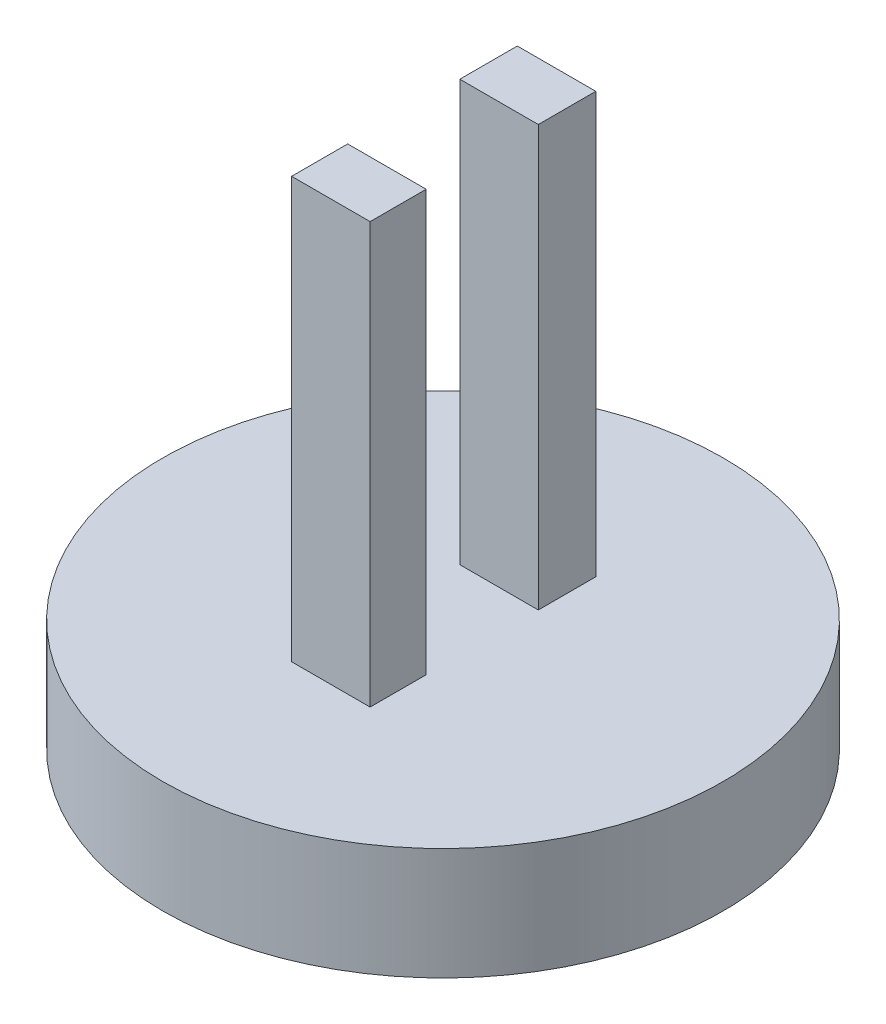
ISO-10303-21;
HEADER;
FILE_DESCRIPTION(('STEP AP214'),'2;1');
FILE_NAME('part.step','',(''),(''),'','','');
FILE_SCHEMA(('AUTOMOTIVE_DESIGN { 1 0 10303 214 1 1 1 1 }'));
ENDSEC;
DATA;
#1=APPLICATION_CONTEXT('core data for automotive mechanical design processes');
#2=APPLICATION_PROTOCOL_DEFINITION('international standard','automotive_design',2000,#1);
#3=PRODUCT_CONTEXT('',#1,'mechanical');
#4=PRODUCT('Part','Part','',(#3));
#5=PRODUCT_RELATED_PRODUCT_CATEGORY('part','',(#4));
#6=PRODUCT_DEFINITION_FORMATION('','',#4);
#7=PRODUCT_DEFINITION_CONTEXT('part definition',#1,'design');
#8=PRODUCT_DEFINITION('design','',#6,#7);
#9=PRODUCT_DEFINITION_SHAPE('','',#8);
#10=(LENGTH_UNIT() NAMED_UNIT(*) SI_UNIT(.MILLI.,.METRE.));
#11=(NAMED_UNIT(*) PLANE_ANGLE_UNIT() SI_UNIT($,.RADIAN.));
#12=(NAMED_UNIT(*) SI_UNIT($,.STERADIAN.) SOLID_ANGLE_UNIT());
#13=UNCERTAINTY_MEASURE_WITH_UNIT(LENGTH_MEASURE(1.E-05),#10,'distance_accuracy_value','');
#14=(GEOMETRIC_REPRESENTATION_CONTEXT(3) GLOBAL_UNCERTAINTY_ASSIGNED_CONTEXT((#13)) GLOBAL_UNIT_ASSIGNED_CONTEXT((#10,
#11,#12)) REPRESENTATION_CONTEXT('',''));
#15=CARTESIAN_POINT('',(0.,0.,0.));
#16=DIRECTION('',(0.,0.,1.));
#17=DIRECTION('',(1.,0.,0.));
#18=AXIS2_PLACEMENT_3D('',#15,#16,#17);
#19=CARTESIAN_POINT('',(0.,5.08,0.));
#20=DIRECTION('',(0.,1.,0.));
#21=DIRECTION('',(0.,0.,1.));
#22=AXIS2_PLACEMENT_3D('',#19,#20,#21);
#23=PLANE('',#22);
#24=DIRECTION('',(0.,0.,-1.));
#25=VECTOR('',#24,1.);
#26=CARTESIAN_POINT('',(-1.778,5.08,-2.54));
#27=LINE('',#26,#25);
#28=CARTESIAN_POINT('',(-1.778,5.08,-2.54));
#29=VERTEX_POINT('',#28);
#30=CARTESIAN_POINT('',(-1.778,5.08,-5.14465691805223));
#31=VERTEX_POINT('',#30);
#32=EDGE_CURVE('E110',#29,#31,#27,.T.);
#33=ORIENTED_EDGE('',*,*,#32,.T.);
#34=DIRECTION('',(1.,0.,0.));
#35=VECTOR('',#34,1.);
#36=CARTESIAN_POINT('',(-1.778,5.08,-5.14465691805223));
#37=LINE('',#36,#35);
#38=CARTESIAN_POINT('',(1.778,5.08,-5.14465691805223));
#39=VERTEX_POINT('',#38);
#40=EDGE_CURVE('E162',#31,#39,#37,.T.);
#41=ORIENTED_EDGE('',*,*,#40,.T.);
#42=DIRECTION('',(0.,0.,-1.));
#43=VECTOR('',#42,1.);
#44=CARTESIAN_POINT('',(1.778,5.08,-2.54));
#45=LINE('',#44,#43);
#46=CARTESIAN_POINT('',(1.778,5.08,-2.54));
#47=VERTEX_POINT('',#46);
#48=EDGE_CURVE('E165',#47,#39,#45,.T.);
#49=ORIENTED_EDGE('',*,*,#48,.F.);
#50=DIRECTION('',(1.,0.,0.));
#51=VECTOR('',#50,1.);
#52=CARTESIAN_POINT('',(-1.778,5.08,-2.54));
#53=LINE('',#52,#51);
#54=EDGE_CURVE('E149',#29,#47,#53,.T.);
#55=ORIENTED_EDGE('',*,*,#54,.F.);
#56=EDGE_LOOP('',(#33,#41,#49,#55));
#57=FACE_BOUND('',#56,.T.);
#58=CARTESIAN_POINT('',(0.,5.08,0.));
#59=DIRECTION('',(0.,1.,0.));
#60=DIRECTION('',(0.,0.,1.));
#61=AXIS2_PLACEMENT_3D('',#58,#59,#60);
#62=CIRCLE('',#61,12.7);
#63=CARTESIAN_POINT('',(0.,5.08,12.7));
#64=VERTEX_POINT('',#63);
#65=EDGE_CURVE('E11',#64,#64,#62,.T.);
#66=ORIENTED_EDGE('',*,*,#65,.T.);
#67=EDGE_LOOP('',(#66));
#68=FACE_BOUND('',#67,.T.);
#69=DIRECTION('',(1.,0.,0.));
#70=VECTOR('',#69,1.);
#71=CARTESIAN_POINT('',(-1.778,5.08,5.08));
#72=LINE('',#71,#70);
#73=CARTESIAN_POINT('',(-1.778,5.08,5.08));
#74=VERTEX_POINT('',#73);
#75=CARTESIAN_POINT('',(1.778,5.08,5.08));
#76=VERTEX_POINT('',#75);
#77=EDGE_CURVE('E55',#74,#76,#72,.T.);
#78=ORIENTED_EDGE('',*,*,#77,.F.);
#79=DIRECTION('',(0.,0.,1.));
#80=VECTOR('',#79,1.);
#81=CARTESIAN_POINT('',(-1.778,5.08,2.54));
#82=LINE('',#81,#80);
#83=CARTESIAN_POINT('',(-1.778,5.08,2.54));
#84=VERTEX_POINT('',#83);
#85=EDGE_CURVE('E102',#84,#74,#82,.T.);
#86=ORIENTED_EDGE('',*,*,#85,.F.);
#87=DIRECTION('',(1.,0.,0.));
#88=VECTOR('',#87,1.);
#89=CARTESIAN_POINT('',(-1.778,5.08,2.54));
#90=LINE('',#89,#88);
#91=CARTESIAN_POINT('',(1.778,5.08,2.54));
#92=VERTEX_POINT('',#91);
#93=EDGE_CURVE('E105',#84,#92,#90,.T.);
#94=ORIENTED_EDGE('',*,*,#93,.T.);
#95=DIRECTION('',(0.,0.,1.));
#96=VECTOR('',#95,1.);
#97=CARTESIAN_POINT('',(1.778,5.08,2.54));
#98=LINE('',#97,#96);
#99=EDGE_CURVE('E60',#92,#76,#98,.T.);
#100=ORIENTED_EDGE('',*,*,#99,.T.);
#101=EDGE_LOOP('',(#78,#86,#94,#100));
#102=FACE_BOUND('',#101,.T.);
#103=ADVANCED_FACE('F39',(#57,#68,#102),#23,.T.);
#104=CARTESIAN_POINT('',(0.,5.08,0.));
#105=DIRECTION('',(0.,-1.,0.));
#106=DIRECTION('',(0.,0.,-1.));
#107=AXIS2_PLACEMENT_3D('',#104,#105,#106);
#108=CYLINDRICAL_SURFACE('',#107,12.7);
#109=ORIENTED_EDGE('',*,*,#65,.F.);
#110=EDGE_LOOP('',(#109));
#111=FACE_BOUND('',#110,.T.);
#112=CARTESIAN_POINT('',(0.,0.,0.));
#113=DIRECTION('',(0.,1.,0.));
#114=DIRECTION('',(0.,0.,1.));
#115=AXIS2_PLACEMENT_3D('',#112,#113,#114);
#116=CIRCLE('',#115,12.7);
#117=CARTESIAN_POINT('',(0.,0.,12.7));
#118=VERTEX_POINT('',#117);
#119=EDGE_CURVE('E43',#118,#118,#116,.T.);
#120=ORIENTED_EDGE('',*,*,#119,.T.);
#121=EDGE_LOOP('',(#120));
#122=FACE_BOUND('',#121,.T.);
#123=ADVANCED_FACE('F41',(#111,#122),#108,.T.);
#124=CARTESIAN_POINT('',(0.,0.,0.));
#125=DIRECTION('',(0.,1.,0.));
#126=DIRECTION('',(0.,0.,1.));
#127=AXIS2_PLACEMENT_3D('',#124,#125,#126);
#128=PLANE('',#127);
#129=ORIENTED_EDGE('',*,*,#119,.F.);
#130=EDGE_LOOP('',(#129));
#131=FACE_BOUND('',#130,.T.);
#132=ADVANCED_FACE('F219',(#131),#128,.F.);
#133=CARTESIAN_POINT('',(-1.778,24.13,-2.54));
#134=DIRECTION('',(-1.,0.,0.));
#135=DIRECTION('',(0.,0.,1.));
#136=AXIS2_PLACEMENT_3D('',#133,#134,#135);
#137=PLANE('',#136);
#138=ORIENTED_EDGE('',*,*,#32,.F.);
#139=DIRECTION('',(0.,-1.,0.));
#140=VECTOR('',#139,1.);
#141=CARTESIAN_POINT('',(-1.778,24.13,-2.54));
#142=LINE('',#141,#140);
#143=CARTESIAN_POINT('',(-1.778,24.13,-2.54));
#144=VERTEX_POINT('',#143);
#145=EDGE_CURVE('E172',#144,#29,#142,.T.);
#146=ORIENTED_EDGE('',*,*,#145,.F.);
#147=DIRECTION('',(0.,0.,-1.));
#148=VECTOR('',#147,1.);
#149=CARTESIAN_POINT('',(-1.778,24.13,-2.54));
#150=LINE('',#149,#148);
#151=CARTESIAN_POINT('',(-1.778,24.13,-5.14465691805223));
#152=VERTEX_POINT('',#151);
#153=EDGE_CURVE('E144',#144,#152,#150,.T.);
#154=ORIENTED_EDGE('',*,*,#153,.T.);
#155=DIRECTION('',(0.,-1.,0.));
#156=VECTOR('',#155,1.);
#157=CARTESIAN_POINT('',(-1.778,24.13,-5.14465691805223));
#158=LINE('',#157,#156);
#159=EDGE_CURVE('E159',#152,#31,#158,.T.);
#160=ORIENTED_EDGE('',*,*,#159,.T.);
#161=EDGE_LOOP('',(#138,#146,#154,#160));
#162=FACE_BOUND('',#161,.T.);
#163=ADVANCED_FACE('F189',(#162),#137,.T.);
#164=CARTESIAN_POINT('',(-1.778,24.13,-2.54));
#165=DIRECTION('',(0.,0.,-1.));
#166=DIRECTION('',(-1.,0.,0.));
#167=AXIS2_PLACEMENT_3D('',#164,#165,#166);
#168=PLANE('',#167);
#169=ORIENTED_EDGE('',*,*,#54,.T.);
#170=DIRECTION('',(0.,-1.,0.));
#171=VECTOR('',#170,1.);
#172=CARTESIAN_POINT('',(1.778,24.13,-2.54));
#173=LINE('',#172,#171);
#174=CARTESIAN_POINT('',(1.778,24.13,-2.54));
#175=VERTEX_POINT('',#174);
#176=EDGE_CURVE('E176',#175,#47,#173,.T.);
#177=ORIENTED_EDGE('',*,*,#176,.F.);
#178=DIRECTION('',(1.,0.,0.));
#179=VECTOR('',#178,1.);
#180=CARTESIAN_POINT('',(-1.778,24.13,-2.54));
#181=LINE('',#180,#179);
#182=EDGE_CURVE('E156',#144,#175,#181,.T.);
#183=ORIENTED_EDGE('',*,*,#182,.F.);
#184=ORIENTED_EDGE('',*,*,#145,.T.);
#185=EDGE_LOOP('',(#169,#177,#183,#184));
#186=FACE_BOUND('',#185,.T.);
#187=ADVANCED_FACE('F200',(#186),#168,.F.);
#188=CARTESIAN_POINT('',(1.778,24.13,-2.54));
#189=DIRECTION('',(-1.,0.,0.));
#190=DIRECTION('',(0.,0.,1.));
#191=AXIS2_PLACEMENT_3D('',#188,#189,#190);
#192=PLANE('',#191);
#193=ORIENTED_EDGE('',*,*,#48,.T.);
#194=DIRECTION('',(0.,-1.,0.));
#195=VECTOR('',#194,1.);
#196=CARTESIAN_POINT('',(1.778,24.13,-5.14465691805223));
#197=LINE('',#196,#195);
#198=CARTESIAN_POINT('',(1.778,24.13,-5.14465691805223));
#199=VERTEX_POINT('',#198);
#200=EDGE_CURVE('E180',#199,#39,#197,.T.);
#201=ORIENTED_EDGE('',*,*,#200,.F.);
#202=DIRECTION('',(0.,0.,-1.));
#203=VECTOR('',#202,1.);
#204=CARTESIAN_POINT('',(1.778,24.13,-2.54));
#205=LINE('',#204,#203);
#206=EDGE_CURVE('E153',#175,#199,#205,.T.);
#207=ORIENTED_EDGE('',*,*,#206,.F.);
#208=ORIENTED_EDGE('',*,*,#176,.T.);
#209=EDGE_LOOP('',(#193,#201,#207,#208));
#210=FACE_BOUND('',#209,.T.);
#211=ADVANCED_FACE('F205',(#210),#192,.F.);
#212=CARTESIAN_POINT('',(-1.778,24.13,-5.14465691805223));
#213=DIRECTION('',(0.,0.,-1.));
#214=DIRECTION('',(-1.,0.,0.));
#215=AXIS2_PLACEMENT_3D('',#212,#213,#214);
#216=PLANE('',#215);
#217=ORIENTED_EDGE('',*,*,#40,.F.);
#218=ORIENTED_EDGE('',*,*,#159,.F.);
#219=DIRECTION('',(1.,0.,0.));
#220=VECTOR('',#219,1.);
#221=CARTESIAN_POINT('',(-1.778,24.13,-5.14465691805223));
#222=LINE('',#221,#220);
#223=EDGE_CURVE('E148',#152,#199,#222,.T.);
#224=ORIENTED_EDGE('',*,*,#223,.T.);
#225=ORIENTED_EDGE('',*,*,#200,.T.);
#226=EDGE_LOOP('',(#217,#218,#224,#225));
#227=FACE_BOUND('',#226,.T.);
#228=ADVANCED_FACE('F193',(#227),#216,.T.);
#229=CARTESIAN_POINT('',(0.,24.13,0.));
#230=DIRECTION('',(0.,-1.,0.));
#231=DIRECTION('',(0.,0.,-1.));
#232=AXIS2_PLACEMENT_3D('',#229,#230,#231);
#233=PLANE('',#232);
#234=ORIENTED_EDGE('',*,*,#153,.F.);
#235=ORIENTED_EDGE('',*,*,#182,.T.);
#236=ORIENTED_EDGE('',*,*,#206,.T.);
#237=ORIENTED_EDGE('',*,*,#223,.F.);
#238=EDGE_LOOP('',(#234,#235,#236,#237));
#239=FACE_BOUND('',#238,.T.);
#240=ADVANCED_FACE('F203',(#239),#233,.F.);
#241=CARTESIAN_POINT('',(-1.778,24.13,2.54));
#242=DIRECTION('',(1.,0.,0.));
#243=DIRECTION('',(0.,0.,-1.));
#244=AXIS2_PLACEMENT_3D('',#241,#242,#243);
#245=PLANE('',#244);
#246=ORIENTED_EDGE('',*,*,#85,.T.);
#247=DIRECTION('',(0.,-1.,0.));
#248=VECTOR('',#247,1.);
#249=CARTESIAN_POINT('',(-1.778,24.13,5.08));
#250=LINE('',#249,#248);
#251=CARTESIAN_POINT('',(-1.778,24.13,5.08));
#252=VERTEX_POINT('',#251);
#253=EDGE_CURVE('E307',#252,#74,#250,.T.);
#254=ORIENTED_EDGE('',*,*,#253,.F.);
#255=DIRECTION('',(0.,0.,1.));
#256=VECTOR('',#255,1.);
#257=CARTESIAN_POINT('',(-1.778,24.13,2.54));
#258=LINE('',#257,#256);
#259=CARTESIAN_POINT('',(-1.778,24.13,2.54));
#260=VERTEX_POINT('',#259);
#261=EDGE_CURVE('E116',#260,#252,#258,.T.);
#262=ORIENTED_EDGE('',*,*,#261,.F.);
#263=DIRECTION('',(0.,-1.,0.));
#264=VECTOR('',#263,1.);
#265=CARTESIAN_POINT('',(-1.778,24.13,2.54));
#266=LINE('',#265,#264);
#267=EDGE_CURVE('E113',#260,#84,#266,.T.);
#268=ORIENTED_EDGE('',*,*,#267,.T.);
#269=EDGE_LOOP('',(#246,#254,#262,#268));
#270=FACE_BOUND('',#269,.T.);
#271=ADVANCED_FACE('F114',(#270),#245,.F.);
#272=CARTESIAN_POINT('',(-1.778,24.13,5.08));
#273=DIRECTION('',(0.,0.,-1.));
#274=DIRECTION('',(-1.,0.,0.));
#275=AXIS2_PLACEMENT_3D('',#272,#273,#274);
#276=PLANE('',#275);
#277=ORIENTED_EDGE('',*,*,#77,.T.);
#278=DIRECTION('',(0.,-1.,0.));
#279=VECTOR('',#278,1.);
#280=CARTESIAN_POINT('',(1.778,24.13,5.08));
#281=LINE('',#280,#279);
#282=CARTESIAN_POINT('',(1.778,24.13,5.08));
#283=VERTEX_POINT('',#282);
#284=EDGE_CURVE('E309',#283,#76,#281,.T.);
#285=ORIENTED_EDGE('',*,*,#284,.F.);
#286=DIRECTION('',(1.,0.,0.));
#287=VECTOR('',#286,1.);
#288=CARTESIAN_POINT('',(-1.778,24.13,5.08));
#289=LINE('',#288,#287);
#290=EDGE_CURVE('E130',#252,#283,#289,.T.);
#291=ORIENTED_EDGE('',*,*,#290,.F.);
#292=ORIENTED_EDGE('',*,*,#253,.T.);
#293=EDGE_LOOP('',(#277,#285,#291,#292));
#294=FACE_BOUND('',#293,.T.);
#295=ADVANCED_FACE('F264',(#294),#276,.F.);
#296=CARTESIAN_POINT('',(1.778,24.13,2.54));
#297=DIRECTION('',(1.,0.,0.));
#298=DIRECTION('',(0.,0.,-1.));
#299=AXIS2_PLACEMENT_3D('',#296,#297,#298);
#300=PLANE('',#299);
#301=ORIENTED_EDGE('',*,*,#99,.F.);
#302=DIRECTION('',(0.,-1.,0.));
#303=VECTOR('',#302,1.);
#304=CARTESIAN_POINT('',(1.778,24.13,2.54));
#305=LINE('',#304,#303);
#306=CARTESIAN_POINT('',(1.778,24.13,2.54));
#307=VERTEX_POINT('',#306);
#308=EDGE_CURVE('E122',#307,#92,#305,.T.);
#309=ORIENTED_EDGE('',*,*,#308,.F.);
#310=DIRECTION('',(0.,0.,1.));
#311=VECTOR('',#310,1.);
#312=CARTESIAN_POINT('',(1.778,24.13,2.54));
#313=LINE('',#312,#311);
#314=EDGE_CURVE('E138',#307,#283,#313,.T.);
#315=ORIENTED_EDGE('',*,*,#314,.T.);
#316=ORIENTED_EDGE('',*,*,#284,.T.);
#317=EDGE_LOOP('',(#301,#309,#315,#316));
#318=FACE_BOUND('',#317,.T.);
#319=ADVANCED_FACE('F273',(#318),#300,.T.);
#320=CARTESIAN_POINT('',(-1.778,24.13,2.54));
#321=DIRECTION('',(0.,0.,-1.));
#322=DIRECTION('',(-1.,0.,0.));
#323=AXIS2_PLACEMENT_3D('',#320,#321,#322);
#324=PLANE('',#323);
#325=ORIENTED_EDGE('',*,*,#93,.F.);
#326=ORIENTED_EDGE('',*,*,#267,.F.);
#327=DIRECTION('',(1.,0.,0.));
#328=VECTOR('',#327,1.);
#329=CARTESIAN_POINT('',(-1.778,24.13,2.54));
#330=LINE('',#329,#328);
#331=EDGE_CURVE('E121',#260,#307,#330,.T.);
#332=ORIENTED_EDGE('',*,*,#331,.T.);
#333=ORIENTED_EDGE('',*,*,#308,.T.);
#334=EDGE_LOOP('',(#325,#326,#332,#333));
#335=FACE_BOUND('',#334,.T.);
#336=ADVANCED_FACE('F124',(#335),#324,.T.);
#337=CARTESIAN_POINT('',(0.,24.13,0.));
#338=DIRECTION('',(0.,1.,0.));
#339=DIRECTION('',(0.,0.,1.));
#340=AXIS2_PLACEMENT_3D('',#337,#338,#339);
#341=PLANE('',#340);
#342=ORIENTED_EDGE('',*,*,#261,.T.);
#343=ORIENTED_EDGE('',*,*,#290,.T.);
#344=ORIENTED_EDGE('',*,*,#314,.F.);
#345=ORIENTED_EDGE('',*,*,#331,.F.);
#346=EDGE_LOOP('',(#342,#343,#344,#345));
#347=FACE_BOUND('',#346,.T.);
#348=ADVANCED_FACE('F292',(#347),#341,.T.);
#349=CLOSED_SHELL('',(#103,#123,#132,#163,#187,#211,#228,#240,#271,#295,#319,#336,#348));
#350=MANIFOLD_SOLID_BREP('B2',#349);
#351=ADVANCED_BREP_SHAPE_REPRESENTATION('',(#18,#350),#14);
#352=SHAPE_DEFINITION_REPRESENTATION(#9,#351);
ENDSEC;
END-ISO-10303-21;
